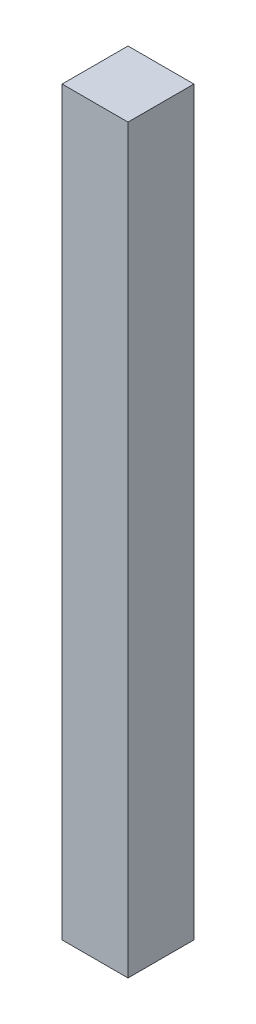
ISO-10303-21;
HEADER;
FILE_DESCRIPTION(('STEP AP214'),'2;1');
FILE_NAME('part.step','',(''),(''),'','','');
FILE_SCHEMA(('AUTOMOTIVE_DESIGN { 1 0 10303 214 1 1 1 1 }'));
ENDSEC;
DATA;
#1=APPLICATION_CONTEXT('core data for automotive mechanical design processes');
#2=APPLICATION_PROTOCOL_DEFINITION('international standard','automotive_design',2000,#1);
#3=PRODUCT_CONTEXT('',#1,'mechanical');
#4=PRODUCT('Part','Part','',(#3));
#5=PRODUCT_RELATED_PRODUCT_CATEGORY('part','',(#4));
#6=PRODUCT_DEFINITION_FORMATION('','',#4);
#7=PRODUCT_DEFINITION_CONTEXT('part definition',#1,'design');
#8=PRODUCT_DEFINITION('design','',#6,#7);
#9=PRODUCT_DEFINITION_SHAPE('','',#8);
#10=(LENGTH_UNIT() NAMED_UNIT(*) SI_UNIT(.MILLI.,.METRE.));
#11=(NAMED_UNIT(*) PLANE_ANGLE_UNIT() SI_UNIT($,.RADIAN.));
#12=(NAMED_UNIT(*) SI_UNIT($,.STERADIAN.) SOLID_ANGLE_UNIT());
#13=UNCERTAINTY_MEASURE_WITH_UNIT(LENGTH_MEASURE(1.E-05),#10,'distance_accuracy_value','');
#14=(GEOMETRIC_REPRESENTATION_CONTEXT(3) GLOBAL_UNCERTAINTY_ASSIGNED_CONTEXT((#13)) GLOBAL_UNIT_ASSIGNED_CONTEXT((#10,
#11,#12)) REPRESENTATION_CONTEXT('',''));
#15=CARTESIAN_POINT('',(0.,0.,0.));
#16=DIRECTION('',(0.,0.,1.));
#17=DIRECTION('',(1.,0.,0.));
#18=AXIS2_PLACEMENT_3D('',#15,#16,#17);
#19=CARTESIAN_POINT('',(20.,450.,-20.));
#20=DIRECTION('',(-1.,0.,0.));
#21=DIRECTION('',(0.,0.,1.));
#22=AXIS2_PLACEMENT_3D('',#19,#20,#21);
#23=PLANE('',#22);
#24=DIRECTION('',(0.,0.,-1.));
#25=VECTOR('',#24,1.);
#26=CARTESIAN_POINT('',(20.,0.,-20.));
#27=LINE('',#26,#25);
#28=CARTESIAN_POINT('',(20.,0.,20.));
#29=VERTEX_POINT('',#28);
#30=CARTESIAN_POINT('',(20.,0.,-20.));
#31=VERTEX_POINT('',#30);
#32=EDGE_CURVE('E97',#29,#31,#27,.T.);
#33=ORIENTED_EDGE('',*,*,#32,.T.);
#34=DIRECTION('',(0.,-1.,0.));
#35=VECTOR('',#34,1.);
#36=CARTESIAN_POINT('',(20.,450.,-20.));
#37=LINE('',#36,#35);
#38=CARTESIAN_POINT('',(20.,450.,-20.));
#39=VERTEX_POINT('',#38);
#40=EDGE_CURVE('E11',#39,#31,#37,.T.);
#41=ORIENTED_EDGE('',*,*,#40,.F.);
#42=DIRECTION('',(0.,0.,-1.));
#43=VECTOR('',#42,1.);
#44=CARTESIAN_POINT('',(20.,450.,-20.));
#45=LINE('',#44,#43);
#46=CARTESIAN_POINT('',(20.,450.,20.));
#47=VERTEX_POINT('',#46);
#48=EDGE_CURVE('E85',#47,#39,#45,.T.);
#49=ORIENTED_EDGE('',*,*,#48,.F.);
#50=DIRECTION('',(0.,-1.,0.));
#51=VECTOR('',#50,1.);
#52=CARTESIAN_POINT('',(20.,450.,20.));
#53=LINE('',#52,#51);
#54=EDGE_CURVE('E93',#47,#29,#53,.T.);
#55=ORIENTED_EDGE('',*,*,#54,.T.);
#56=EDGE_LOOP('',(#33,#41,#49,#55));
#57=FACE_BOUND('',#56,.T.);
#58=ADVANCED_FACE('F34',(#57),#23,.F.);
#59=CARTESIAN_POINT('',(-20.,450.,-20.));
#60=DIRECTION('',(0.,0.,1.));
#61=DIRECTION('',(1.,0.,0.));
#62=AXIS2_PLACEMENT_3D('',#59,#60,#61);
#63=PLANE('',#62);
#64=DIRECTION('',(-1.,0.,0.));
#65=VECTOR('',#64,1.);
#66=CARTESIAN_POINT('',(-20.,0.,-20.));
#67=LINE('',#66,#65);
#68=CARTESIAN_POINT('',(-20.,0.,-20.));
#69=VERTEX_POINT('',#68);
#70=EDGE_CURVE('E89',#31,#69,#67,.T.);
#71=ORIENTED_EDGE('',*,*,#70,.T.);
#72=DIRECTION('',(0.,-1.,0.));
#73=VECTOR('',#72,1.);
#74=CARTESIAN_POINT('',(-20.,450.,-20.));
#75=LINE('',#74,#73);
#76=CARTESIAN_POINT('',(-20.,450.,-20.));
#77=VERTEX_POINT('',#76);
#78=EDGE_CURVE('E42',#77,#69,#75,.T.);
#79=ORIENTED_EDGE('',*,*,#78,.F.);
#80=DIRECTION('',(-1.,0.,0.));
#81=VECTOR('',#80,1.);
#82=CARTESIAN_POINT('',(-20.,450.,-20.));
#83=LINE('',#82,#81);
#84=EDGE_CURVE('E80',#39,#77,#83,.T.);
#85=ORIENTED_EDGE('',*,*,#84,.F.);
#86=ORIENTED_EDGE('',*,*,#40,.T.);
#87=EDGE_LOOP('',(#71,#79,#85,#86));
#88=FACE_BOUND('',#87,.T.);
#89=ADVANCED_FACE('F88',(#88),#63,.F.);
#90=CARTESIAN_POINT('',(-20.,450.,-20.));
#91=DIRECTION('',(1.,0.,0.));
#92=DIRECTION('',(0.,0.,-1.));
#93=AXIS2_PLACEMENT_3D('',#90,#91,#92);
#94=PLANE('',#93);
#95=DIRECTION('',(0.,0.,1.));
#96=VECTOR('',#95,1.);
#97=CARTESIAN_POINT('',(-20.,0.,-20.));
#98=LINE('',#97,#96);
#99=CARTESIAN_POINT('',(-20.,0.,20.));
#100=VERTEX_POINT('',#99);
#101=EDGE_CURVE('E67',#69,#100,#98,.T.);
#102=ORIENTED_EDGE('',*,*,#101,.T.);
#103=DIRECTION('',(0.,-1.,0.));
#104=VECTOR('',#103,1.);
#105=CARTESIAN_POINT('',(-20.,450.,20.));
#106=LINE('',#105,#104);
#107=CARTESIAN_POINT('',(-20.,450.,20.));
#108=VERTEX_POINT('',#107);
#109=EDGE_CURVE('E90',#108,#100,#106,.T.);
#110=ORIENTED_EDGE('',*,*,#109,.F.);
#111=DIRECTION('',(0.,0.,1.));
#112=VECTOR('',#111,1.);
#113=CARTESIAN_POINT('',(-20.,450.,-20.));
#114=LINE('',#113,#112);
#115=EDGE_CURVE('E83',#77,#108,#114,.T.);
#116=ORIENTED_EDGE('',*,*,#115,.F.);
#117=ORIENTED_EDGE('',*,*,#78,.T.);
#118=EDGE_LOOP('',(#102,#110,#116,#117));
#119=FACE_BOUND('',#118,.T.);
#120=ADVANCED_FACE('F91',(#119),#94,.F.);
#121=CARTESIAN_POINT('',(-20.,450.,20.));
#122=DIRECTION('',(0.,0.,-1.));
#123=DIRECTION('',(-1.,0.,0.));
#124=AXIS2_PLACEMENT_3D('',#121,#122,#123);
#125=PLANE('',#124);
#126=DIRECTION('',(1.,0.,0.));
#127=VECTOR('',#126,1.);
#128=CARTESIAN_POINT('',(-20.,0.,20.));
#129=LINE('',#128,#127);
#130=EDGE_CURVE('E73',#100,#29,#129,.T.);
#131=ORIENTED_EDGE('',*,*,#130,.T.);
#132=ORIENTED_EDGE('',*,*,#54,.F.);
#133=DIRECTION('',(1.,0.,0.));
#134=VECTOR('',#133,1.);
#135=CARTESIAN_POINT('',(-20.,450.,20.));
#136=LINE('',#135,#134);
#137=EDGE_CURVE('E50',#108,#47,#136,.T.);
#138=ORIENTED_EDGE('',*,*,#137,.F.);
#139=ORIENTED_EDGE('',*,*,#109,.T.);
#140=EDGE_LOOP('',(#131,#132,#138,#139));
#141=FACE_BOUND('',#140,.T.);
#142=ADVANCED_FACE('F104',(#141),#125,.F.);
#143=CARTESIAN_POINT('',(0.,450.,0.));
#144=DIRECTION('',(0.,1.,0.));
#145=DIRECTION('',(0.,0.,1.));
#146=AXIS2_PLACEMENT_3D('',#143,#144,#145);
#147=PLANE('',#146);
#148=ORIENTED_EDGE('',*,*,#48,.T.);
#149=ORIENTED_EDGE('',*,*,#84,.T.);
#150=ORIENTED_EDGE('',*,*,#115,.T.);
#151=ORIENTED_EDGE('',*,*,#137,.T.);
#152=EDGE_LOOP('',(#148,#149,#150,#151));
#153=FACE_BOUND('',#152,.T.);
#154=ADVANCED_FACE('F81',(#153),#147,.T.);
#155=CARTESIAN_POINT('',(0.,0.,0.));
#156=DIRECTION('',(0.,1.,0.));
#157=DIRECTION('',(0.,0.,1.));
#158=AXIS2_PLACEMENT_3D('',#155,#156,#157);
#159=PLANE('',#158);
#160=ORIENTED_EDGE('',*,*,#32,.F.);
#161=ORIENTED_EDGE('',*,*,#130,.F.);
#162=ORIENTED_EDGE('',*,*,#101,.F.);
#163=ORIENTED_EDGE('',*,*,#70,.F.);
#164=EDGE_LOOP('',(#160,#161,#162,#163));
#165=FACE_BOUND('',#164,.T.);
#166=ADVANCED_FACE('F107',(#165),#159,.F.);
#167=CLOSED_SHELL('',(#58,#89,#120,#142,#154,#166));
#168=MANIFOLD_SOLID_BREP('B2',#167);
#169=ADVANCED_BREP_SHAPE_REPRESENTATION('',(#18,#168),#14);
#170=SHAPE_DEFINITION_REPRESENTATION(#9,#169);
ENDSEC;
END-ISO-10303-21;
